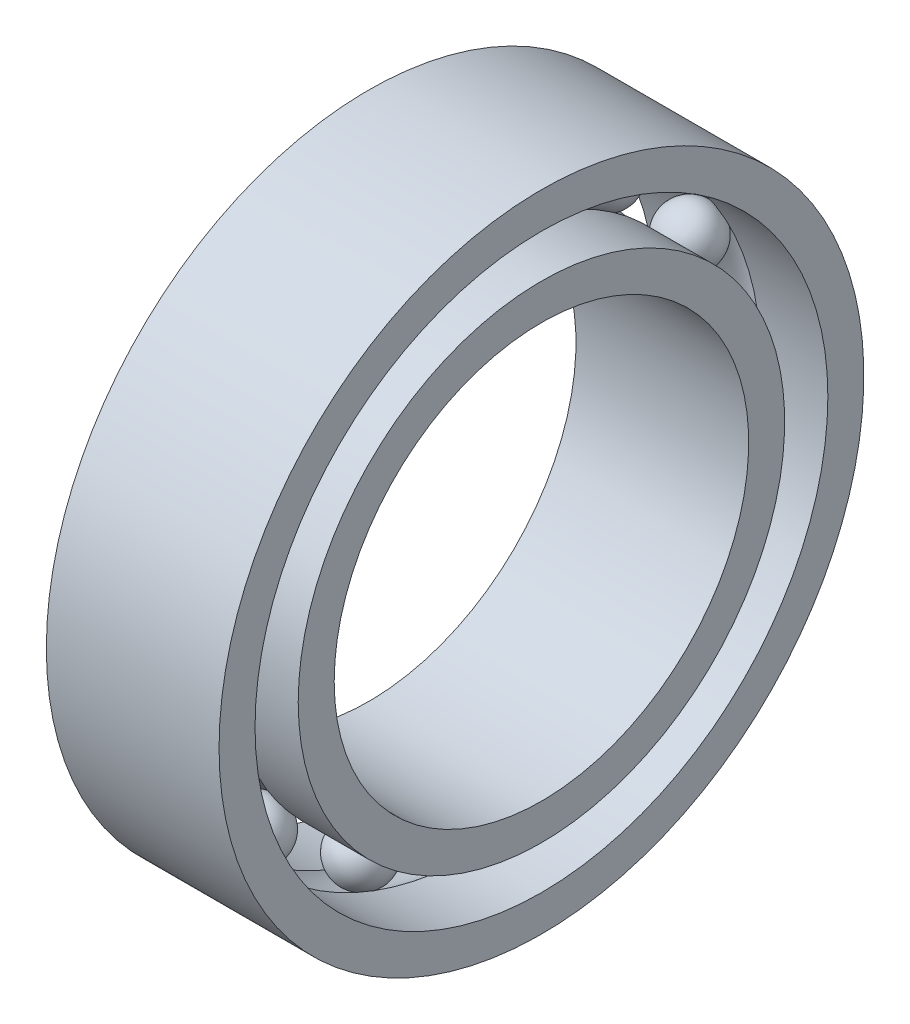
ISO-10303-21;
HEADER;
FILE_DESCRIPTION(('STEP AP214'),'2;1');
FILE_NAME('part.step','',(''),(''),'','','');
FILE_SCHEMA(('AUTOMOTIVE_DESIGN { 1 0 10303 214 1 1 1 1 }'));
ENDSEC;
DATA;
#1=APPLICATION_CONTEXT('core data for automotive mechanical design processes');
#2=APPLICATION_PROTOCOL_DEFINITION('international standard','automotive_design',2000,#1);
#3=PRODUCT_CONTEXT('',#1,'mechanical');
#4=PRODUCT('Part','Part','',(#3));
#5=PRODUCT_RELATED_PRODUCT_CATEGORY('part','',(#4));
#6=PRODUCT_DEFINITION_FORMATION('','',#4);
#7=PRODUCT_DEFINITION_CONTEXT('part definition',#1,'design');
#8=PRODUCT_DEFINITION('design','',#6,#7);
#9=PRODUCT_DEFINITION_SHAPE('','',#8);
#10=(LENGTH_UNIT() NAMED_UNIT(*) SI_UNIT(.MILLI.,.METRE.));
#11=(NAMED_UNIT(*) PLANE_ANGLE_UNIT() SI_UNIT($,.RADIAN.));
#12=(NAMED_UNIT(*) SI_UNIT($,.STERADIAN.) SOLID_ANGLE_UNIT());
#13=UNCERTAINTY_MEASURE_WITH_UNIT(LENGTH_MEASURE(1.E-05),#10,'distance_accuracy_value','');
#14=(GEOMETRIC_REPRESENTATION_CONTEXT(3) GLOBAL_UNCERTAINTY_ASSIGNED_CONTEXT((#13)) GLOBAL_UNIT_ASSIGNED_CONTEXT((#10,
#11,#12)) REPRESENTATION_CONTEXT('',''));
#15=CARTESIAN_POINT('',(0.,0.,0.));
#16=DIRECTION('',(0.,0.,1.));
#17=DIRECTION('',(1.,0.,0.));
#18=AXIS2_PLACEMENT_3D('',#15,#16,#17);
#19=CARTESIAN_POINT('',(0.,-10.6886329570064,-20.365488590024));
#20=DIRECTION('',(-1.,0.,0.));
#21=DIRECTION('',(0.,-0.464723172043757,-0.885456025653216));
#22=AXIS2_PLACEMENT_3D('',#19,#20,#21);
#23=SPHERICAL_SURFACE('',#22,2.5);
#24=CARTESIAN_POINT('',(-2.5,-10.6886329570064,-20.365488590024));
#25=VERTEX_POINT('',#24);
#26=VERTEX_LOOP('',#25);
#27=FACE_BOUND('',#26,.T.);
#28=ADVANCED_FACE('F44',(#27),#23,.T.);
#29=CLOSED_SHELL('',(#28));
#30=MANIFOLD_SOLID_BREP('B2',#29);
#31=CARTESIAN_POINT('',(0.,-18.9286289155539,-13.0654891748168));
#32=DIRECTION('',(-1.,0.,0.));
#33=DIRECTION('',(0.,-0.822983865893649,-0.568064746731166));
#34=AXIS2_PLACEMENT_3D('',#31,#32,#33);
#35=SPHERICAL_SURFACE('',#34,2.5);
#36=CARTESIAN_POINT('',(-2.5,-18.9286289155539,-13.0654891748168));
#37=VERTEX_POINT('',#36);
#38=VERTEX_LOOP('',#37);
#39=FACE_BOUND('',#38,.T.);
#40=ADVANCED_FACE('F72',(#39),#35,.T.);
#41=CLOSED_SHELL('',(#40));
#42=MANIFOLD_SOLID_BREP('B6',#41);
#43=CARTESIAN_POINT('',(0.,-22.8323041042552,-2.77234364587268));
#44=DIRECTION('',(-1.,0.,0.));
#45=DIRECTION('',(0.,-0.992708874098053,-0.120536680255334));
#46=AXIS2_PLACEMENT_3D('',#43,#44,#45);
#47=SPHERICAL_SURFACE('',#46,2.5);
#48=CARTESIAN_POINT('',(-2.5,-22.8323041042552,-2.77234364587268));
#49=VERTEX_POINT('',#48);
#50=VERTEX_LOOP('',#49);
#51=FACE_BOUND('',#50,.T.);
#52=ADVANCED_FACE('F100',(#51),#47,.T.);
#53=CLOSED_SHELL('',(#52));
#54=MANIFOLD_SOLID_BREP('B40',#53);
#55=CARTESIAN_POINT('',(0.,-21.5053735817646,8.15591240197812));
#56=DIRECTION('',(-1.,0.,0.));
#57=DIRECTION('',(0.,-0.935016242685418,0.354604887042527));
#58=AXIS2_PLACEMENT_3D('',#55,#56,#57);
#59=SPHERICAL_SURFACE('',#58,2.5);
#60=CARTESIAN_POINT('',(-2.5,-21.5053735817646,8.15591240197812));
#61=VERTEX_POINT('',#60);
#62=VERTEX_LOOP('',#61);
#63=FACE_BOUND('',#62,.T.);
#64=ADVANCED_FACE('F128',(#63),#59,.T.);
#65=CLOSED_SHELL('',(#64));
#66=MANIFOLD_SOLID_BREP('B68',#65);
#67=CARTESIAN_POINT('',(0.,-15.2518211395384,17.2157472079352));
#68=DIRECTION('',(-1.,0.,0.));
#69=DIRECTION('',(0.,-0.663122658240802,0.748510748171095));
#70=AXIS2_PLACEMENT_3D('',#67,#68,#69);
#71=SPHERICAL_SURFACE('',#70,2.5);
#72=CARTESIAN_POINT('',(-2.5,-15.2518211395384,17.2157472079352));
#73=VERTEX_POINT('',#72);
#74=VERTEX_LOOP('',#73);
#75=FACE_BOUND('',#74,.T.);
#76=ADVANCED_FACE('F156',(#75),#71,.T.);
#77=CLOSED_SHELL('',(#76));
#78=MANIFOLD_SOLID_BREP('B96',#77);
#79=CARTESIAN_POINT('',(0.,-5.504260278614,22.3316618007992));
#80=DIRECTION('',(-1.,0.,0.));
#81=DIRECTION('',(0.,-0.239315664287565,0.97094181742605));
#82=AXIS2_PLACEMENT_3D('',#79,#80,#81);
#83=SPHERICAL_SURFACE('',#82,2.5);
#84=CARTESIAN_POINT('',(-2.5,-5.504260278614,22.3316618007992));
#85=VERTEX_POINT('',#84);
#86=VERTEX_LOOP('',#85);
#87=FACE_BOUND('',#86,.T.);
#88=ADVANCED_FACE('F184',(#87),#83,.T.);
#89=CLOSED_SHELL('',(#88));
#90=MANIFOLD_SOLID_BREP('B124',#89);
#91=CARTESIAN_POINT('',(0.,5.50426027861369,22.3316618007992));
#92=DIRECTION('',(-1.,0.,0.));
#93=DIRECTION('',(0.,0.239315664287552,0.970941817426054));
#94=AXIS2_PLACEMENT_3D('',#91,#92,#93);
#95=SPHERICAL_SURFACE('',#94,2.5);
#96=CARTESIAN_POINT('',(-2.5,5.50426027861369,22.3316618007992));
#97=VERTEX_POINT('',#96);
#98=VERTEX_LOOP('',#97);
#99=FACE_BOUND('',#98,.T.);
#100=ADVANCED_FACE('F212',(#99),#95,.T.);
#101=CLOSED_SHELL('',(#100));
#102=MANIFOLD_SOLID_BREP('B152',#101);
#103=CARTESIAN_POINT('',(0.,15.2518211395382,17.2157472079354));
#104=DIRECTION('',(-1.,0.,0.));
#105=DIRECTION('',(0.,0.663122658240791,0.748510748171105));
#106=AXIS2_PLACEMENT_3D('',#103,#104,#105);
#107=SPHERICAL_SURFACE('',#106,2.5);
#108=CARTESIAN_POINT('',(-2.5,15.2518211395382,17.2157472079354));
#109=VERTEX_POINT('',#108);
#110=VERTEX_LOOP('',#109);
#111=FACE_BOUND('',#110,.T.);
#112=ADVANCED_FACE('F240',(#111),#107,.T.);
#113=CLOSED_SHELL('',(#112));
#114=MANIFOLD_SOLID_BREP('B180',#113);
#115=CARTESIAN_POINT('',(0.,21.5053735817645,8.15591240197841));
#116=DIRECTION('',(-1.,0.,0.));
#117=DIRECTION('',(0.,0.935016242685413,0.35460488704254));
#118=AXIS2_PLACEMENT_3D('',#115,#116,#117);
#119=SPHERICAL_SURFACE('',#118,2.5);
#120=CARTESIAN_POINT('',(-2.5,21.5053735817645,8.15591240197841));
#121=VERTEX_POINT('',#120);
#122=VERTEX_LOOP('',#121);
#123=FACE_BOUND('',#122,.T.);
#124=ADVANCED_FACE('F268',(#123),#119,.T.);
#125=CLOSED_SHELL('',(#124));
#126=MANIFOLD_SOLID_BREP('B208',#125);
#127=CARTESIAN_POINT('',(0.,22.8323041042553,-2.77234364587236));
#128=DIRECTION('',(-1.,0.,0.));
#129=DIRECTION('',(0.,0.992708874098054,-0.12053668025532));
#130=AXIS2_PLACEMENT_3D('',#127,#128,#129);
#131=SPHERICAL_SURFACE('',#130,2.5);
#132=CARTESIAN_POINT('',(-2.5,22.8323041042553,-2.77234364587236));
#133=VERTEX_POINT('',#132);
#134=VERTEX_LOOP('',#133);
#135=FACE_BOUND('',#134,.T.);
#136=ADVANCED_FACE('F296',(#135),#131,.T.);
#137=CLOSED_SHELL('',(#136));
#138=MANIFOLD_SOLID_BREP('B236',#137);
#139=CARTESIAN_POINT('',(0.,18.9286289155541,-13.0654891748165));
#140=DIRECTION('',(-1.,0.,0.));
#141=DIRECTION('',(0.,0.822983865893658,-0.568064746731154));
#142=AXIS2_PLACEMENT_3D('',#139,#140,#141);
#143=SPHERICAL_SURFACE('',#142,2.5);
#144=CARTESIAN_POINT('',(-2.5,18.9286289155541,-13.0654891748165));
#145=VERTEX_POINT('',#144);
#146=VERTEX_LOOP('',#145);
#147=FACE_BOUND('',#146,.T.);
#148=ADVANCED_FACE('F324',(#147),#143,.T.);
#149=CLOSED_SHELL('',(#148));
#150=MANIFOLD_SOLID_BREP('B264',#149);
#151=CARTESIAN_POINT('',(0.,10.6886329570067,-20.3654885900238));
#152=DIRECTION('',(-1.,0.,0.));
#153=DIRECTION('',(0.,0.46472317204377,-0.885456025653209));
#154=AXIS2_PLACEMENT_3D('',#151,#152,#153);
#155=SPHERICAL_SURFACE('',#154,2.5);
#156=CARTESIAN_POINT('',(-2.5,10.6886329570067,-20.3654885900238));
#157=VERTEX_POINT('',#156);
#158=VERTEX_LOOP('',#157);
#159=FACE_BOUND('',#158,.T.);
#160=ADVANCED_FACE('F352',(#159),#155,.T.);
#161=CLOSED_SHELL('',(#160));
#162=MANIFOLD_SOLID_BREP('B292',#161);
#163=CARTESIAN_POINT('',(0.,0.,-23.));
#164=DIRECTION('',(-1.,0.,0.));
#165=DIRECTION('',(0.,0.,-1.));
#166=AXIS2_PLACEMENT_3D('',#163,#164,#165);
#167=SPHERICAL_SURFACE('',#166,2.5);
#168=CARTESIAN_POINT('',(-2.5,0.,-23.));
#169=VERTEX_POINT('',#168);
#170=VERTEX_LOOP('',#169);
#171=FACE_BOUND('',#170,.T.);
#172=ADVANCED_FACE('F382',(#171),#167,.T.);
#173=CLOSED_SHELL('',(#172));
#174=MANIFOLD_SOLID_BREP('B320',#173);
#175=CARTESIAN_POINT('',(0.,0.,0.));
#176=DIRECTION('',(-1.,0.,0.));
#177=DIRECTION('',(0.,0.,1.));
#178=AXIS2_PLACEMENT_3D('',#175,#176,#177);
#179=TOROIDAL_SURFACE('',#178,23.,2.5);
#180=CARTESIAN_POINT('',(-1.65359456941538,0.,0.));
#181=DIRECTION('',(-1.,0.,0.));
#182=DIRECTION('',(0.,0.,1.));
#183=AXIS2_PLACEMENT_3D('',#180,#181,#182);
#184=CIRCLE('',#183,24.875);
#185=CARTESIAN_POINT('',(-1.65359456941538,0.,24.875));
#186=VERTEX_POINT('',#185);
#187=EDGE_CURVE('E438',#186,#186,#184,.T.);
#188=ORIENTED_EDGE('',*,*,#187,.T.);
#189=EDGE_LOOP('',(#188));
#190=FACE_BOUND('',#189,.T.);
#191=CARTESIAN_POINT('',(1.65359456941538,0.,0.));
#192=DIRECTION('',(-1.,0.,0.));
#193=DIRECTION('',(0.,0.,1.));
#194=AXIS2_PLACEMENT_3D('',#191,#192,#193);
#195=CIRCLE('',#194,24.875);
#196=CARTESIAN_POINT('',(1.65359456941538,0.,24.875));
#197=VERTEX_POINT('',#196);
#198=EDGE_CURVE('E381',#197,#197,#195,.T.);
#199=ORIENTED_EDGE('',*,*,#198,.F.);
#200=EDGE_LOOP('',(#199));
#201=FACE_BOUND('',#200,.T.);
#202=ADVANCED_FACE('F411',(#190,#201),#179,.F.);
#203=CARTESIAN_POINT('',(-1000.,0.,0.));
#204=DIRECTION('',(-1.,0.,0.));
#205=DIRECTION('',(0.,0.,1.));
#206=AXIS2_PLACEMENT_3D('',#203,#204,#205);
#207=CYLINDRICAL_SURFACE('',#206,24.875);
#208=CARTESIAN_POINT('',(7.50000000000006,0.,0.));
#209=DIRECTION('',(-1.,0.,0.));
#210=DIRECTION('',(0.,0.,1.));
#211=AXIS2_PLACEMENT_3D('',#208,#209,#210);
#212=CIRCLE('',#211,24.875);
#213=CARTESIAN_POINT('',(7.50000000000006,0.,24.875));
#214=VERTEX_POINT('',#213);
#215=EDGE_CURVE('E418',#214,#214,#212,.T.);
#216=ORIENTED_EDGE('',*,*,#215,.F.);
#217=EDGE_LOOP('',(#216));
#218=FACE_BOUND('',#217,.T.);
#219=ORIENTED_EDGE('',*,*,#198,.T.);
#220=EDGE_LOOP('',(#219));
#221=FACE_BOUND('',#220,.T.);
#222=ADVANCED_FACE('F463',(#218,#221),#207,.F.);
#223=CARTESIAN_POINT('',(7.5,0.,0.));
#224=DIRECTION('',(-1.,0.,0.));
#225=DIRECTION('',(0.,0.,1.));
#226=AXIS2_PLACEMENT_3D('',#223,#224,#225);
#227=PLANE('',#226);
#228=CARTESIAN_POINT('',(7.50000000000006,0.,0.));
#229=DIRECTION('',(-1.,0.,0.));
#230=DIRECTION('',(0.,0.,1.));
#231=AXIS2_PLACEMENT_3D('',#228,#229,#230);
#232=CIRCLE('',#231,28.);
#233=CARTESIAN_POINT('',(7.50000000000006,0.,28.));
#234=VERTEX_POINT('',#233);
#235=EDGE_CURVE('E423',#234,#234,#232,.T.);
#236=ORIENTED_EDGE('',*,*,#235,.F.);
#237=EDGE_LOOP('',(#236));
#238=FACE_BOUND('',#237,.T.);
#239=ORIENTED_EDGE('',*,*,#215,.T.);
#240=EDGE_LOOP('',(#239));
#241=FACE_BOUND('',#240,.T.);
#242=ADVANCED_FACE('F459',(#238,#241),#227,.F.);
#243=CARTESIAN_POINT('',(-1000.,0.,0.));
#244=DIRECTION('',(-1.,0.,0.));
#245=DIRECTION('',(0.,0.,1.));
#246=AXIS2_PLACEMENT_3D('',#243,#244,#245);
#247=CYLINDRICAL_SURFACE('',#246,28.);
#248=ORIENTED_EDGE('',*,*,#235,.T.);
#249=EDGE_LOOP('',(#248));
#250=FACE_BOUND('',#249,.T.);
#251=CARTESIAN_POINT('',(-7.49999999999995,0.,0.));
#252=DIRECTION('',(-1.,0.,0.));
#253=DIRECTION('',(0.,0.,1.));
#254=AXIS2_PLACEMENT_3D('',#251,#252,#253);
#255=CIRCLE('',#254,28.);
#256=CARTESIAN_POINT('',(-7.49999999999995,0.,28.));
#257=VERTEX_POINT('',#256);
#258=EDGE_CURVE('E428',#257,#257,#255,.T.);
#259=ORIENTED_EDGE('',*,*,#258,.F.);
#260=EDGE_LOOP('',(#259));
#261=FACE_BOUND('',#260,.T.);
#262=ADVANCED_FACE('F453',(#250,#261),#247,.T.);
#263=CARTESIAN_POINT('',(-7.5,0.,0.));
#264=DIRECTION('',(-1.,0.,0.));
#265=DIRECTION('',(0.,0.,1.));
#266=AXIS2_PLACEMENT_3D('',#263,#264,#265);
#267=PLANE('',#266);
#268=ORIENTED_EDGE('',*,*,#258,.T.);
#269=EDGE_LOOP('',(#268));
#270=FACE_BOUND('',#269,.T.);
#271=CARTESIAN_POINT('',(-7.49999999999995,0.,0.));
#272=DIRECTION('',(-1.,0.,0.));
#273=DIRECTION('',(0.,0.,1.));
#274=AXIS2_PLACEMENT_3D('',#271,#272,#273);
#275=CIRCLE('',#274,24.875);
#276=CARTESIAN_POINT('',(-7.49999999999995,0.,24.875));
#277=VERTEX_POINT('',#276);
#278=EDGE_CURVE('E434',#277,#277,#275,.T.);
#279=ORIENTED_EDGE('',*,*,#278,.F.);
#280=EDGE_LOOP('',(#279));
#281=FACE_BOUND('',#280,.T.);
#282=ADVANCED_FACE('F448',(#270,#281),#267,.T.);
#283=CARTESIAN_POINT('',(-1000.,0.,0.));
#284=DIRECTION('',(-1.,0.,0.));
#285=DIRECTION('',(0.,0.,1.));
#286=AXIS2_PLACEMENT_3D('',#283,#284,#285);
#287=CYLINDRICAL_SURFACE('',#286,24.875);
#288=ORIENTED_EDGE('',*,*,#187,.F.);
#289=EDGE_LOOP('',(#288));
#290=FACE_BOUND('',#289,.T.);
#291=ORIENTED_EDGE('',*,*,#278,.T.);
#292=EDGE_LOOP('',(#291));
#293=FACE_BOUND('',#292,.T.);
#294=ADVANCED_FACE('F445',(#290,#293),#287,.F.);
#295=CLOSED_SHELL('',(#202,#222,#242,#262,#282,#294));
#296=MANIFOLD_SOLID_BREP('B348',#295);
#297=CARTESIAN_POINT('',(0.,0.,0.));
#298=DIRECTION('',(-1.,0.,0.));
#299=DIRECTION('',(0.,0.,1.));
#300=AXIS2_PLACEMENT_3D('',#297,#298,#299);
#301=TOROIDAL_SURFACE('',#300,23.,2.5);
#302=CARTESIAN_POINT('',(1.65359456941538,0.,0.));
#303=DIRECTION('',(-1.,0.,0.));
#304=DIRECTION('',(0.,0.,1.));
#305=AXIS2_PLACEMENT_3D('',#302,#303,#304);
#306=CIRCLE('',#305,21.125);
#307=CARTESIAN_POINT('',(1.65359456941538,0.,21.125));
#308=VERTEX_POINT('',#307);
#309=EDGE_CURVE('E540',#308,#308,#306,.T.);
#310=ORIENTED_EDGE('',*,*,#309,.T.);
#311=EDGE_LOOP('',(#310));
#312=FACE_BOUND('',#311,.T.);
#313=CARTESIAN_POINT('',(-1.65359456941538,0.,0.));
#314=DIRECTION('',(-1.,0.,0.));
#315=DIRECTION('',(0.,0.,1.));
#316=AXIS2_PLACEMENT_3D('',#313,#314,#315);
#317=CIRCLE('',#316,21.125);
#318=CARTESIAN_POINT('',(-1.65359456941538,0.,21.125));
#319=VERTEX_POINT('',#318);
#320=EDGE_CURVE('E410',#319,#319,#317,.T.);
#321=ORIENTED_EDGE('',*,*,#320,.F.);
#322=EDGE_LOOP('',(#321));
#323=FACE_BOUND('',#322,.T.);
#324=ADVANCED_FACE('F518',(#312,#323),#301,.F.);
#325=CARTESIAN_POINT('',(-1000.,0.,0.));
#326=DIRECTION('',(-1.,0.,0.));
#327=DIRECTION('',(0.,0.,1.));
#328=AXIS2_PLACEMENT_3D('',#325,#326,#327);
#329=CYLINDRICAL_SURFACE('',#328,21.125);
#330=ORIENTED_EDGE('',*,*,#320,.T.);
#331=EDGE_LOOP('',(#330));
#332=FACE_BOUND('',#331,.T.);
#333=CARTESIAN_POINT('',(-7.49999999999995,0.,0.));
#334=DIRECTION('',(-1.,0.,0.));
#335=DIRECTION('',(0.,0.,1.));
#336=AXIS2_PLACEMENT_3D('',#333,#334,#335);
#337=CIRCLE('',#336,21.125);
#338=CARTESIAN_POINT('',(-7.49999999999995,0.,21.125));
#339=VERTEX_POINT('',#338);
#340=EDGE_CURVE('E524',#339,#339,#337,.T.);
#341=ORIENTED_EDGE('',*,*,#340,.F.);
#342=EDGE_LOOP('',(#341));
#343=FACE_BOUND('',#342,.T.);
#344=ADVANCED_FACE('F558',(#332,#343),#329,.T.);
#345=CARTESIAN_POINT('',(-7.5,0.,0.));
#346=DIRECTION('',(1.,0.,0.));
#347=DIRECTION('',(0.,0.,-1.));
#348=AXIS2_PLACEMENT_3D('',#345,#346,#347);
#349=PLANE('',#348);
#350=CARTESIAN_POINT('',(-7.49999999999995,0.,0.));
#351=DIRECTION('',(-1.,0.,0.));
#352=DIRECTION('',(0.,0.,1.));
#353=AXIS2_PLACEMENT_3D('',#350,#351,#352);
#354=CIRCLE('',#353,18.);
#355=CARTESIAN_POINT('',(-7.49999999999995,0.,18.));
#356=VERTEX_POINT('',#355);
#357=EDGE_CURVE('E528',#356,#356,#354,.T.);
#358=ORIENTED_EDGE('',*,*,#357,.F.);
#359=EDGE_LOOP('',(#358));
#360=FACE_BOUND('',#359,.T.);
#361=ORIENTED_EDGE('',*,*,#340,.T.);
#362=EDGE_LOOP('',(#361));
#363=FACE_BOUND('',#362,.T.);
#364=ADVANCED_FACE('F562',(#360,#363),#349,.F.);
#365=CARTESIAN_POINT('',(-1000.,0.,0.));
#366=DIRECTION('',(-1.,0.,0.));
#367=DIRECTION('',(0.,0.,1.));
#368=AXIS2_PLACEMENT_3D('',#365,#366,#367);
#369=CYLINDRICAL_SURFACE('',#368,18.);
#370=CARTESIAN_POINT('',(7.50000000000006,0.,0.));
#371=DIRECTION('',(-1.,0.,0.));
#372=DIRECTION('',(0.,0.,1.));
#373=AXIS2_PLACEMENT_3D('',#370,#371,#372);
#374=CIRCLE('',#373,18.);
#375=CARTESIAN_POINT('',(7.50000000000006,0.,18.));
#376=VERTEX_POINT('',#375);
#377=EDGE_CURVE('E532',#376,#376,#374,.T.);
#378=ORIENTED_EDGE('',*,*,#377,.F.);
#379=EDGE_LOOP('',(#378));
#380=FACE_BOUND('',#379,.T.);
#381=ORIENTED_EDGE('',*,*,#357,.T.);
#382=EDGE_LOOP('',(#381));
#383=FACE_BOUND('',#382,.T.);
#384=ADVANCED_FACE('F554',(#380,#383),#369,.F.);
#385=CARTESIAN_POINT('',(7.5,0.,0.));
#386=DIRECTION('',(1.,0.,0.));
#387=DIRECTION('',(0.,0.,-1.));
#388=AXIS2_PLACEMENT_3D('',#385,#386,#387);
#389=PLANE('',#388);
#390=ORIENTED_EDGE('',*,*,#377,.T.);
#391=EDGE_LOOP('',(#390));
#392=FACE_BOUND('',#391,.T.);
#393=CARTESIAN_POINT('',(7.50000000000006,0.,0.));
#394=DIRECTION('',(-1.,0.,0.));
#395=DIRECTION('',(0.,0.,1.));
#396=AXIS2_PLACEMENT_3D('',#393,#394,#395);
#397=CIRCLE('',#396,21.125);
#398=CARTESIAN_POINT('',(7.50000000000006,0.,21.125));
#399=VERTEX_POINT('',#398);
#400=EDGE_CURVE('E537',#399,#399,#397,.T.);
#401=ORIENTED_EDGE('',*,*,#400,.F.);
#402=EDGE_LOOP('',(#401));
#403=FACE_BOUND('',#402,.T.);
#404=ADVANCED_FACE('F548',(#392,#403),#389,.T.);
#405=CARTESIAN_POINT('',(-1000.,0.,0.));
#406=DIRECTION('',(-1.,0.,0.));
#407=DIRECTION('',(0.,0.,1.));
#408=AXIS2_PLACEMENT_3D('',#405,#406,#407);
#409=CYLINDRICAL_SURFACE('',#408,21.125);
#410=ORIENTED_EDGE('',*,*,#400,.T.);
#411=EDGE_LOOP('',(#410));
#412=FACE_BOUND('',#411,.T.);
#413=ORIENTED_EDGE('',*,*,#309,.F.);
#414=EDGE_LOOP('',(#413));
#415=FACE_BOUND('',#414,.T.);
#416=ADVANCED_FACE('F546',(#412,#415),#409,.T.);
#417=CLOSED_SHELL('',(#324,#344,#364,#384,#404,#416));
#418=MANIFOLD_SOLID_BREP('B376',#417);
#419=ADVANCED_BREP_SHAPE_REPRESENTATION('',(#18,#30,#42,#54,#66,#78,#90,#102,#114,#126,#138,
#150,#162,#174,#296,#418),#14);
#420=SHAPE_DEFINITION_REPRESENTATION(#9,#419);
ENDSEC;
END-ISO-10303-21;
